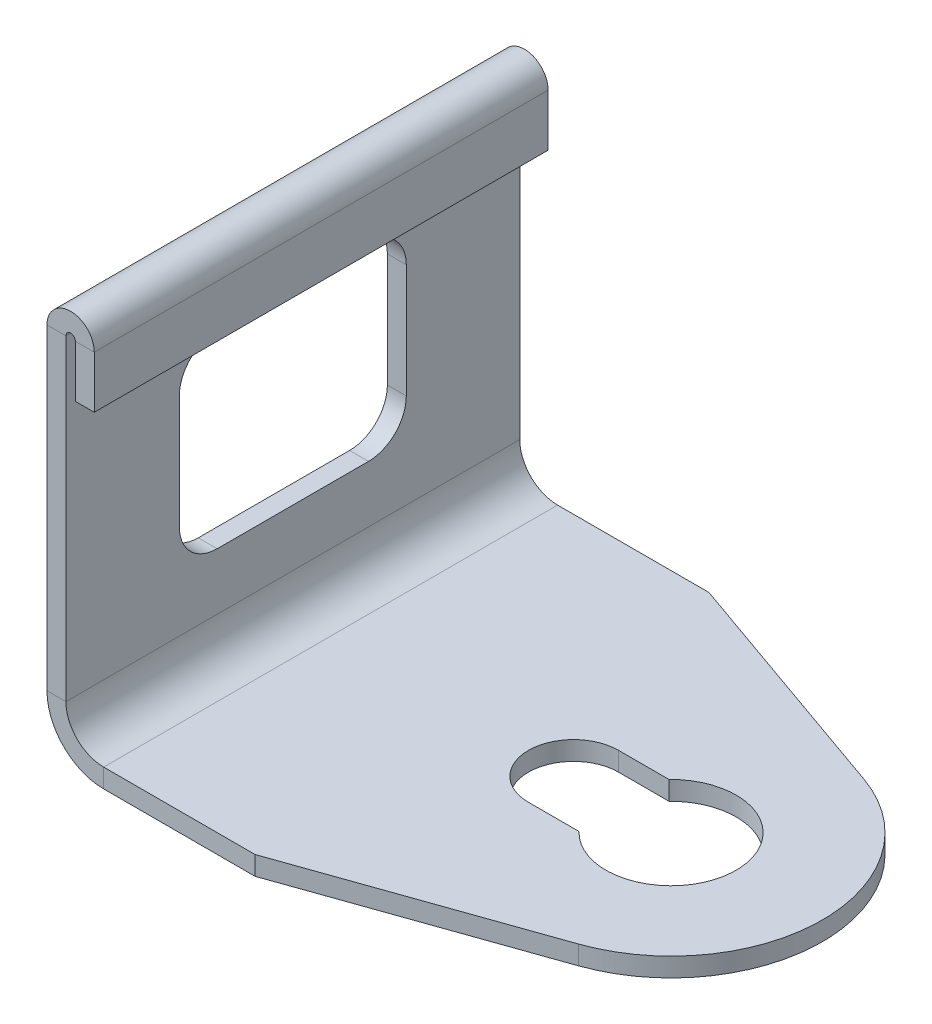
ISO-10303-21;
HEADER;
FILE_DESCRIPTION(('STEP AP214'),'2;1');
FILE_NAME('part.step','',(''),(''),'','','');
FILE_SCHEMA(('AUTOMOTIVE_DESIGN { 1 0 10303 214 1 1 1 1 }'));
ENDSEC;
DATA;
#1=APPLICATION_CONTEXT('core data for automotive mechanical design processes');
#2=APPLICATION_PROTOCOL_DEFINITION('international standard','automotive_design',2000,#1);
#3=PRODUCT_CONTEXT('',#1,'mechanical');
#4=PRODUCT('Part','Part','',(#3));
#5=PRODUCT_RELATED_PRODUCT_CATEGORY('part','',(#4));
#6=PRODUCT_DEFINITION_FORMATION('','',#4);
#7=PRODUCT_DEFINITION_CONTEXT('part definition',#1,'design');
#8=PRODUCT_DEFINITION('design','',#6,#7);
#9=PRODUCT_DEFINITION_SHAPE('','',#8);
#10=(LENGTH_UNIT() NAMED_UNIT(*) SI_UNIT(.MILLI.,.METRE.));
#11=(NAMED_UNIT(*) PLANE_ANGLE_UNIT() SI_UNIT($,.RADIAN.));
#12=(NAMED_UNIT(*) SI_UNIT($,.STERADIAN.) SOLID_ANGLE_UNIT());
#13=UNCERTAINTY_MEASURE_WITH_UNIT(LENGTH_MEASURE(1.E-05),#10,'distance_accuracy_value','');
#14=(GEOMETRIC_REPRESENTATION_CONTEXT(3) GLOBAL_UNCERTAINTY_ASSIGNED_CONTEXT((#13)) GLOBAL_UNIT_ASSIGNED_CONTEXT((#10,
#11,#12)) REPRESENTATION_CONTEXT('',''));
#15=CARTESIAN_POINT('',(0.,0.,0.));
#16=DIRECTION('',(0.,0.,1.));
#17=DIRECTION('',(1.,0.,0.));
#18=AXIS2_PLACEMENT_3D('',#15,#16,#17);
#19=CARTESIAN_POINT('',(15.5,1.,0.));
#20=DIRECTION('',(0.,1.,0.));
#21=DIRECTION('',(0.,0.,1.));
#22=AXIS2_PLACEMENT_3D('',#19,#20,#21);
#23=PLANE('',#22);
#24=DIRECTION('',(-1.,0.,0.));
#25=VECTOR('',#24,1.);
#26=CARTESIAN_POINT('',(10.34,1.,-2.38));
#27=LINE('',#26,#25);
#28=CARTESIAN_POINT('',(13.0124709060631,1.,-2.38));
#29=VERTEX_POINT('',#28);
#30=CARTESIAN_POINT('',(10.34,1.,-2.38));
#31=VERTEX_POINT('',#30);
#32=EDGE_CURVE('E405',#29,#31,#27,.T.);
#33=ORIENTED_EDGE('',*,*,#32,.F.);
#34=CARTESIAN_POINT('',(15.5,1.,0.));
#35=DIRECTION('',(0.,1.,0.));
#36=DIRECTION('',(0.,0.,1.));
#37=AXIS2_PLACEMENT_3D('',#34,#35,#36);
#38=CIRCLE('',#37,3.44270257111799);
#39=CARTESIAN_POINT('',(13.0124709060631,1.,2.38));
#40=VERTEX_POINT('',#39);
#41=EDGE_CURVE('E403',#40,#29,#38,.T.);
#42=ORIENTED_EDGE('',*,*,#41,.F.);
#43=DIRECTION('',(1.,0.,0.));
#44=VECTOR('',#43,1.);
#45=CARTESIAN_POINT('',(10.34,1.,2.38));
#46=LINE('',#45,#44);
#47=CARTESIAN_POINT('',(10.34,1.,2.38));
#48=VERTEX_POINT('',#47);
#49=EDGE_CURVE('E411',#48,#40,#46,.T.);
#50=ORIENTED_EDGE('',*,*,#49,.F.);
#51=CARTESIAN_POINT('',(10.34,1.,0.));
#52=DIRECTION('',(0.,1.,0.));
#53=DIRECTION('',(0.,0.,1.));
#54=AXIS2_PLACEMENT_3D('',#51,#52,#53);
#55=CIRCLE('',#54,2.38);
#56=EDGE_CURVE('E408',#31,#48,#55,.T.);
#57=ORIENTED_EDGE('',*,*,#56,.F.);
#58=EDGE_LOOP('',(#33,#42,#50,#57));
#59=FACE_BOUND('',#58,.T.);
#60=DIRECTION('',(-1.,0.,0.));
#61=VECTOR('',#60,1.);
#62=CARTESIAN_POINT('',(-5.50000000000001,1.,-12.));
#63=LINE('',#62,#61);
#64=CARTESIAN_POINT('',(5.49999999999999,1.,-12.));
#65=VERTEX_POINT('',#64);
#66=CARTESIAN_POINT('',(-2.50000000000001,1.,-12.));
#67=VERTEX_POINT('',#66);
#68=EDGE_CURVE('E442',#65,#67,#63,.T.);
#69=ORIENTED_EDGE('',*,*,#68,.T.);
#70=DIRECTION('',(0.,0.,1.));
#71=VECTOR('',#70,1.);
#72=CARTESIAN_POINT('',(-2.50000000000001,1.,12.));
#73=LINE('',#72,#71);
#74=CARTESIAN_POINT('',(-2.50000000000001,1.,12.));
#75=VERTEX_POINT('',#74);
#76=EDGE_CURVE('E392',#75,#67,#73,.F.);
#77=ORIENTED_EDGE('',*,*,#76,.F.);
#78=DIRECTION('',(1.,0.,0.));
#79=VECTOR('',#78,1.);
#80=CARTESIAN_POINT('',(-5.5,1.,12.));
#81=LINE('',#80,#79);
#82=CARTESIAN_POINT('',(5.5,1.,12.));
#83=VERTEX_POINT('',#82);
#84=EDGE_CURVE('E445',#75,#83,#81,.T.);
#85=ORIENTED_EDGE('',*,*,#84,.T.);
#86=DIRECTION('',(0.943295404303227,0.,-0.331954485163873));
#87=VECTOR('',#86,1.);
#88=CARTESIAN_POINT('',(18.155635881311,1.,7.54636323442581));
#89=LINE('',#88,#87);
#90=CARTESIAN_POINT('',(18.155635881311,1.,7.54636323442581));
#91=VERTEX_POINT('',#90);
#92=EDGE_CURVE('E434',#83,#91,#89,.T.);
#93=ORIENTED_EDGE('',*,*,#92,.T.);
#94=CARTESIAN_POINT('',(15.5,1.,0.));
#95=DIRECTION('',(0.,1.,0.));
#96=DIRECTION('',(0.,0.,1.));
#97=AXIS2_PLACEMENT_3D('',#94,#95,#96);
#98=CIRCLE('',#97,8.);
#99=CARTESIAN_POINT('',(18.155635881311,1.,-7.54636323442582));
#100=VERTEX_POINT('',#99);
#101=EDGE_CURVE('E437',#91,#100,#98,.T.);
#102=ORIENTED_EDGE('',*,*,#101,.T.);
#103=DIRECTION('',(-0.943295404303227,0.,-0.331954485163872));
#104=VECTOR('',#103,1.);
#105=CARTESIAN_POINT('',(18.155635881311,1.,-7.54636323442582));
#106=LINE('',#105,#104);
#107=EDGE_CURVE('E440',#100,#65,#106,.T.);
#108=ORIENTED_EDGE('',*,*,#107,.T.);
#109=EDGE_LOOP('',(#69,#77,#85,#93,#102,#108));
#110=FACE_BOUND('',#109,.T.);
#111=ADVANCED_FACE('F59',(#59,#110),#23,.T.);
#112=CARTESIAN_POINT('',(15.5,0.,0.));
#113=DIRECTION('',(0.,1.,0.));
#114=DIRECTION('',(0.,0.,1.));
#115=AXIS2_PLACEMENT_3D('',#112,#113,#114);
#116=PLANE('',#115);
#117=CARTESIAN_POINT('',(15.5,0.,0.));
#118=DIRECTION('',(0.,1.,0.));
#119=DIRECTION('',(0.,0.,1.));
#120=AXIS2_PLACEMENT_3D('',#117,#118,#119);
#121=CIRCLE('',#120,3.44270257111799);
#122=CARTESIAN_POINT('',(13.0124709060631,0.,2.38));
#123=VERTEX_POINT('',#122);
#124=CARTESIAN_POINT('',(13.0124709060631,0.,-2.38));
#125=VERTEX_POINT('',#124);
#126=EDGE_CURVE('E400',#123,#125,#121,.T.);
#127=ORIENTED_EDGE('',*,*,#126,.T.);
#128=DIRECTION('',(-1.,0.,0.));
#129=VECTOR('',#128,1.);
#130=CARTESIAN_POINT('',(10.34,0.,-2.38));
#131=LINE('',#130,#129);
#132=CARTESIAN_POINT('',(10.34,0.,-2.38));
#133=VERTEX_POINT('',#132);
#134=EDGE_CURVE('E416',#125,#133,#131,.T.);
#135=ORIENTED_EDGE('',*,*,#134,.T.);
#136=CARTESIAN_POINT('',(10.34,0.,0.));
#137=DIRECTION('',(0.,1.,0.));
#138=DIRECTION('',(0.,0.,1.));
#139=AXIS2_PLACEMENT_3D('',#136,#137,#138);
#140=CIRCLE('',#139,2.38);
#141=CARTESIAN_POINT('',(10.34,0.,2.38));
#142=VERTEX_POINT('',#141);
#143=EDGE_CURVE('E419',#133,#142,#140,.T.);
#144=ORIENTED_EDGE('',*,*,#143,.T.);
#145=DIRECTION('',(1.,0.,0.));
#146=VECTOR('',#145,1.);
#147=CARTESIAN_POINT('',(10.34,0.,2.38));
#148=LINE('',#147,#146);
#149=EDGE_CURVE('E406',#142,#123,#148,.T.);
#150=ORIENTED_EDGE('',*,*,#149,.T.);
#151=EDGE_LOOP('',(#127,#135,#144,#150));
#152=FACE_BOUND('',#151,.T.);
#153=DIRECTION('',(0.,0.,1.));
#154=VECTOR('',#153,1.);
#155=CARTESIAN_POINT('',(-2.50000000000001,0.,12.));
#156=LINE('',#155,#154);
#157=CARTESIAN_POINT('',(-2.50000000000001,0.,12.));
#158=VERTEX_POINT('',#157);
#159=CARTESIAN_POINT('',(-2.50000000000001,0.,-12.));
#160=VERTEX_POINT('',#159);
#161=EDGE_CURVE('E380',#158,#160,#156,.F.);
#162=ORIENTED_EDGE('',*,*,#161,.T.);
#163=DIRECTION('',(-1.,0.,0.));
#164=VECTOR('',#163,1.);
#165=CARTESIAN_POINT('',(-5.50000000000001,0.,-12.));
#166=LINE('',#165,#164);
#167=CARTESIAN_POINT('',(5.49999999999999,0.,-12.));
#168=VERTEX_POINT('',#167);
#169=EDGE_CURVE('E454',#168,#160,#166,.T.);
#170=ORIENTED_EDGE('',*,*,#169,.F.);
#171=DIRECTION('',(-0.943295404303227,0.,-0.331954485163872));
#172=VECTOR('',#171,1.);
#173=CARTESIAN_POINT('',(18.155635881311,0.,-7.54636323442582));
#174=LINE('',#173,#172);
#175=CARTESIAN_POINT('',(18.155635881311,0.,-7.54636323442582));
#176=VERTEX_POINT('',#175);
#177=EDGE_CURVE('E452',#176,#168,#174,.T.);
#178=ORIENTED_EDGE('',*,*,#177,.F.);
#179=CARTESIAN_POINT('',(15.5,0.,0.));
#180=DIRECTION('',(0.,1.,0.));
#181=DIRECTION('',(0.,0.,1.));
#182=AXIS2_PLACEMENT_3D('',#179,#180,#181);
#183=CIRCLE('',#182,8.);
#184=CARTESIAN_POINT('',(18.155635881311,0.,7.54636323442581));
#185=VERTEX_POINT('',#184);
#186=EDGE_CURVE('E450',#185,#176,#183,.T.);
#187=ORIENTED_EDGE('',*,*,#186,.F.);
#188=DIRECTION('',(0.943295404303227,0.,-0.331954485163873));
#189=VECTOR('',#188,1.);
#190=CARTESIAN_POINT('',(18.155635881311,0.,7.54636323442581));
#191=LINE('',#190,#189);
#192=CARTESIAN_POINT('',(5.5,0.,12.));
#193=VERTEX_POINT('',#192);
#194=EDGE_CURVE('E433',#193,#185,#191,.T.);
#195=ORIENTED_EDGE('',*,*,#194,.F.);
#196=DIRECTION('',(1.,0.,0.));
#197=VECTOR('',#196,1.);
#198=CARTESIAN_POINT('',(-5.5,0.,12.));
#199=LINE('',#198,#197);
#200=EDGE_CURVE('E438',#158,#193,#199,.T.);
#201=ORIENTED_EDGE('',*,*,#200,.F.);
#202=EDGE_LOOP('',(#162,#170,#178,#187,#195,#201));
#203=FACE_BOUND('',#202,.T.);
#204=ADVANCED_FACE('F472',(#152,#203),#116,.F.);
#205=CARTESIAN_POINT('',(-5.50000000000001,1.,-12.));
#206=DIRECTION('',(0.,0.,1.));
#207=DIRECTION('',(1.,0.,0.));
#208=AXIS2_PLACEMENT_3D('',#205,#206,#207);
#209=PLANE('',#208);
#210=DIRECTION('',(0.,-1.,0.));
#211=VECTOR('',#210,1.);
#212=CARTESIAN_POINT('',(-2.50000000000001,1.,-12.));
#213=LINE('',#212,#211);
#214=EDGE_CURVE('E397',#67,#160,#213,.T.);
#215=ORIENTED_EDGE('',*,*,#214,.F.);
#216=ORIENTED_EDGE('',*,*,#68,.F.);
#217=DIRECTION('',(0.,-1.,0.));
#218=VECTOR('',#217,1.);
#219=CARTESIAN_POINT('',(5.49999999999999,1.,-12.));
#220=LINE('',#219,#218);
#221=EDGE_CURVE('E460',#65,#168,#220,.T.);
#222=ORIENTED_EDGE('',*,*,#221,.T.);
#223=ORIENTED_EDGE('',*,*,#169,.T.);
#224=EDGE_LOOP('',(#215,#216,#222,#223));
#225=FACE_BOUND('',#224,.T.);
#226=ADVANCED_FACE('F476',(#225),#209,.F.);
#227=CARTESIAN_POINT('',(-5.5,1.,12.));
#228=DIRECTION('',(0.,0.,-1.));
#229=DIRECTION('',(-1.,0.,0.));
#230=AXIS2_PLACEMENT_3D('',#227,#228,#229);
#231=PLANE('',#230);
#232=DIRECTION('',(0.,-1.,0.));
#233=VECTOR('',#232,1.);
#234=CARTESIAN_POINT('',(-2.50000000000001,1.,12.));
#235=LINE('',#234,#233);
#236=EDGE_CURVE('E386',#75,#158,#235,.T.);
#237=ORIENTED_EDGE('',*,*,#236,.T.);
#238=ORIENTED_EDGE('',*,*,#200,.T.);
#239=DIRECTION('',(0.,-1.,0.));
#240=VECTOR('',#239,1.);
#241=CARTESIAN_POINT('',(5.5,1.,12.));
#242=LINE('',#241,#240);
#243=EDGE_CURVE('E447',#83,#193,#242,.T.);
#244=ORIENTED_EDGE('',*,*,#243,.F.);
#245=ORIENTED_EDGE('',*,*,#84,.F.);
#246=EDGE_LOOP('',(#237,#238,#244,#245));
#247=FACE_BOUND('',#246,.T.);
#248=ADVANCED_FACE('F548',(#247),#231,.F.);
#249=CARTESIAN_POINT('',(18.155635881311,1.,7.54636323442581));
#250=DIRECTION('',(-0.331954485163873,0.,-0.943295404303227));
#251=DIRECTION('',(-0.943295404303227,0.,0.331954485163873));
#252=AXIS2_PLACEMENT_3D('',#249,#250,#251);
#253=PLANE('',#252);
#254=ORIENTED_EDGE('',*,*,#194,.T.);
#255=DIRECTION('',(0.,-1.,0.));
#256=VECTOR('',#255,1.);
#257=CARTESIAN_POINT('',(18.155635881311,1.,7.54636323442581));
#258=LINE('',#257,#256);
#259=EDGE_CURVE('E13',#91,#185,#258,.T.);
#260=ORIENTED_EDGE('',*,*,#259,.F.);
#261=ORIENTED_EDGE('',*,*,#92,.F.);
#262=ORIENTED_EDGE('',*,*,#243,.T.);
#263=EDGE_LOOP('',(#254,#260,#261,#262));
#264=FACE_BOUND('',#263,.T.);
#265=ADVANCED_FACE('F61',(#264),#253,.F.);
#266=CARTESIAN_POINT('',(15.5,1.,0.));
#267=DIRECTION('',(0.,-1.,0.));
#268=DIRECTION('',(0.,0.,-1.));
#269=AXIS2_PLACEMENT_3D('',#266,#267,#268);
#270=CYLINDRICAL_SURFACE('',#269,8.);
#271=ORIENTED_EDGE('',*,*,#186,.T.);
#272=DIRECTION('',(0.,-1.,0.));
#273=VECTOR('',#272,1.);
#274=CARTESIAN_POINT('',(18.155635881311,1.,-7.54636323442582));
#275=LINE('',#274,#273);
#276=EDGE_CURVE('E67',#100,#176,#275,.T.);
#277=ORIENTED_EDGE('',*,*,#276,.F.);
#278=ORIENTED_EDGE('',*,*,#101,.F.);
#279=ORIENTED_EDGE('',*,*,#259,.T.);
#280=EDGE_LOOP('',(#271,#277,#278,#279));
#281=FACE_BOUND('',#280,.T.);
#282=ADVANCED_FACE('F555',(#281),#270,.T.);
#283=CARTESIAN_POINT('',(18.155635881311,1.,-7.54636323442582));
#284=DIRECTION('',(-0.331954485163872,0.,0.943295404303227));
#285=DIRECTION('',(0.943295404303227,0.,0.331954485163872));
#286=AXIS2_PLACEMENT_3D('',#283,#284,#285);
#287=PLANE('',#286);
#288=ORIENTED_EDGE('',*,*,#177,.T.);
#289=ORIENTED_EDGE('',*,*,#221,.F.);
#290=ORIENTED_EDGE('',*,*,#107,.F.);
#291=ORIENTED_EDGE('',*,*,#276,.T.);
#292=EDGE_LOOP('',(#288,#289,#290,#291));
#293=FACE_BOUND('',#292,.T.);
#294=ADVANCED_FACE('F467',(#293),#287,.F.);
#295=CARTESIAN_POINT('',(15.5,1.,0.));
#296=DIRECTION('',(0.,-1.,0.));
#297=DIRECTION('',(0.,0.,-1.));
#298=AXIS2_PLACEMENT_3D('',#295,#296,#297);
#299=CYLINDRICAL_SURFACE('',#298,3.44270257111799);
#300=ORIENTED_EDGE('',*,*,#126,.F.);
#301=DIRECTION('',(0.,-1.,0.));
#302=VECTOR('',#301,1.);
#303=CARTESIAN_POINT('',(13.0124709060631,1.,2.38));
#304=LINE('',#303,#302);
#305=EDGE_CURVE('E413',#40,#123,#304,.T.);
#306=ORIENTED_EDGE('',*,*,#305,.F.);
#307=ORIENTED_EDGE('',*,*,#41,.T.);
#308=DIRECTION('',(0.,-1.,0.));
#309=VECTOR('',#308,1.);
#310=CARTESIAN_POINT('',(13.0124709060631,1.,-2.38));
#311=LINE('',#310,#309);
#312=EDGE_CURVE('E430',#29,#125,#311,.T.);
#313=ORIENTED_EDGE('',*,*,#312,.T.);
#314=EDGE_LOOP('',(#300,#306,#307,#313));
#315=FACE_BOUND('',#314,.T.);
#316=ADVANCED_FACE('F545',(#315),#299,.F.);
#317=CARTESIAN_POINT('',(10.34,1.,-2.38));
#318=DIRECTION('',(0.,0.,1.));
#319=DIRECTION('',(1.,0.,0.));
#320=AXIS2_PLACEMENT_3D('',#317,#318,#319);
#321=PLANE('',#320);
#322=ORIENTED_EDGE('',*,*,#134,.F.);
#323=ORIENTED_EDGE('',*,*,#312,.F.);
#324=ORIENTED_EDGE('',*,*,#32,.T.);
#325=DIRECTION('',(0.,-1.,0.));
#326=VECTOR('',#325,1.);
#327=CARTESIAN_POINT('',(10.34,1.,-2.38));
#328=LINE('',#327,#326);
#329=EDGE_CURVE('E428',#31,#133,#328,.T.);
#330=ORIENTED_EDGE('',*,*,#329,.T.);
#331=EDGE_LOOP('',(#322,#323,#324,#330));
#332=FACE_BOUND('',#331,.T.);
#333=ADVANCED_FACE('F596',(#332),#321,.T.);
#334=CARTESIAN_POINT('',(10.34,1.,0.));
#335=DIRECTION('',(0.,-1.,0.));
#336=DIRECTION('',(0.,0.,-1.));
#337=AXIS2_PLACEMENT_3D('',#334,#335,#336);
#338=CYLINDRICAL_SURFACE('',#337,2.38);
#339=ORIENTED_EDGE('',*,*,#143,.F.);
#340=ORIENTED_EDGE('',*,*,#329,.F.);
#341=ORIENTED_EDGE('',*,*,#56,.T.);
#342=DIRECTION('',(0.,-1.,0.));
#343=VECTOR('',#342,1.);
#344=CARTESIAN_POINT('',(10.34,1.,2.38));
#345=LINE('',#344,#343);
#346=EDGE_CURVE('E426',#48,#142,#345,.T.);
#347=ORIENTED_EDGE('',*,*,#346,.T.);
#348=EDGE_LOOP('',(#339,#340,#341,#347));
#349=FACE_BOUND('',#348,.T.);
#350=ADVANCED_FACE('F593',(#349),#338,.F.);
#351=CARTESIAN_POINT('',(10.34,1.,2.38));
#352=DIRECTION('',(0.,0.,-1.));
#353=DIRECTION('',(-1.,0.,0.));
#354=AXIS2_PLACEMENT_3D('',#351,#352,#353);
#355=PLANE('',#354);
#356=ORIENTED_EDGE('',*,*,#149,.F.);
#357=ORIENTED_EDGE('',*,*,#346,.F.);
#358=ORIENTED_EDGE('',*,*,#49,.T.);
#359=ORIENTED_EDGE('',*,*,#305,.T.);
#360=EDGE_LOOP('',(#356,#357,#358,#359));
#361=FACE_BOUND('',#360,.T.);
#362=ADVANCED_FACE('F588',(#361),#355,.T.);
#363=CARTESIAN_POINT('',(-2.50000000000001,3.,-12.));
#364=DIRECTION('',(0.,0.,-1.));
#365=DIRECTION('',(-1.,0.,0.));
#366=AXIS2_PLACEMENT_3D('',#363,#364,#365);
#367=PLANE('',#366);
#368=DIRECTION('',(1.,0.,0.));
#369=VECTOR('',#368,1.);
#370=CARTESIAN_POINT('',(-5.50000000000001,2.99999999999999,-12.));
#371=LINE('',#370,#369);
#372=CARTESIAN_POINT('',(-4.50000000000001,2.99999999999999,-12.));
#373=VERTEX_POINT('',#372);
#374=CARTESIAN_POINT('',(-5.50000000000001,2.99999999999999,-12.));
#375=VERTEX_POINT('',#374);
#376=EDGE_CURVE('E357',#373,#375,#371,.F.);
#377=ORIENTED_EDGE('',*,*,#376,.F.);
#378=CARTESIAN_POINT('',(-2.50000000000001,3.,-12.));
#379=DIRECTION('',(0.,0.,1.));
#380=DIRECTION('',(1.,0.,0.));
#381=AXIS2_PLACEMENT_3D('',#378,#379,#380);
#382=CIRCLE('',#381,2.);
#383=EDGE_CURVE('E389',#67,#373,#382,.F.);
#384=ORIENTED_EDGE('',*,*,#383,.F.);
#385=ORIENTED_EDGE('',*,*,#214,.T.);
#386=CARTESIAN_POINT('',(-2.50000000000001,3.,-12.));
#387=DIRECTION('',(0.,0.,1.));
#388=DIRECTION('',(1.,0.,0.));
#389=AXIS2_PLACEMENT_3D('',#386,#387,#388);
#390=CIRCLE('',#389,3.);
#391=EDGE_CURVE('E382',#160,#375,#390,.F.);
#392=ORIENTED_EDGE('',*,*,#391,.T.);
#393=EDGE_LOOP('',(#377,#384,#385,#392));
#394=FACE_BOUND('',#393,.T.);
#395=ADVANCED_FACE('F482',(#394),#367,.T.);
#396=CARTESIAN_POINT('',(-2.50000000000001,3.,12.));
#397=DIRECTION('',(0.,0.,-1.));
#398=DIRECTION('',(-1.,0.,0.));
#399=AXIS2_PLACEMENT_3D('',#396,#397,#398);
#400=PLANE('',#399);
#401=CARTESIAN_POINT('',(-2.50000000000001,3.,12.));
#402=DIRECTION('',(0.,0.,1.));
#403=DIRECTION('',(1.,0.,0.));
#404=AXIS2_PLACEMENT_3D('',#401,#402,#403);
#405=CIRCLE('',#404,2.);
#406=CARTESIAN_POINT('',(-4.50000000000001,3.,12.));
#407=VERTEX_POINT('',#406);
#408=EDGE_CURVE('E362',#407,#75,#405,.T.);
#409=ORIENTED_EDGE('',*,*,#408,.F.);
#410=DIRECTION('',(1.,0.,0.));
#411=VECTOR('',#410,1.);
#412=CARTESIAN_POINT('',(-4.50000000000001,2.99999999999999,12.));
#413=LINE('',#412,#411);
#414=CARTESIAN_POINT('',(-5.50000000000001,2.99999999999999,12.));
#415=VERTEX_POINT('',#414);
#416=EDGE_CURVE('E373',#407,#415,#413,.F.);
#417=ORIENTED_EDGE('',*,*,#416,.T.);
#418=CARTESIAN_POINT('',(-2.50000000000001,3.,12.));
#419=DIRECTION('',(0.,0.,1.));
#420=DIRECTION('',(1.,0.,0.));
#421=AXIS2_PLACEMENT_3D('',#418,#419,#420);
#422=CIRCLE('',#421,3.);
#423=EDGE_CURVE('E383',#415,#158,#422,.T.);
#424=ORIENTED_EDGE('',*,*,#423,.T.);
#425=ORIENTED_EDGE('',*,*,#236,.F.);
#426=EDGE_LOOP('',(#409,#417,#424,#425));
#427=FACE_BOUND('',#426,.T.);
#428=ADVANCED_FACE('F568',(#427),#400,.F.);
#429=CARTESIAN_POINT('',(-2.50000000000001,3.,12.));
#430=DIRECTION('',(0.,0.,1.));
#431=DIRECTION('',(-1.,0.,0.));
#432=AXIS2_PLACEMENT_3D('',#429,#430,#431);
#433=CYLINDRICAL_SURFACE('',#432,3.);
#434=ORIENTED_EDGE('',*,*,#161,.F.);
#435=ORIENTED_EDGE('',*,*,#423,.F.);
#436=DIRECTION('',(0.,0.,1.));
#437=VECTOR('',#436,1.);
#438=CARTESIAN_POINT('',(-5.50000000000001,2.99999999999999,-12.));
#439=LINE('',#438,#437);
#440=EDGE_CURVE('E370',#415,#375,#439,.F.);
#441=ORIENTED_EDGE('',*,*,#440,.T.);
#442=ORIENTED_EDGE('',*,*,#391,.F.);
#443=EDGE_LOOP('',(#434,#435,#441,#442));
#444=FACE_BOUND('',#443,.T.);
#445=ADVANCED_FACE('F484',(#444),#433,.T.);
#446=CARTESIAN_POINT('',(-2.50000000000001,3.,12.));
#447=DIRECTION('',(0.,0.,1.));
#448=DIRECTION('',(-1.,0.,0.));
#449=AXIS2_PLACEMENT_3D('',#446,#447,#448);
#450=CYLINDRICAL_SURFACE('',#449,2.);
#451=ORIENTED_EDGE('',*,*,#76,.T.);
#452=ORIENTED_EDGE('',*,*,#383,.T.);
#453=DIRECTION('',(0.,0.,1.));
#454=VECTOR('',#453,1.);
#455=CARTESIAN_POINT('',(-4.50000000000001,2.99999999999999,-12.));
#456=LINE('',#455,#454);
#457=EDGE_CURVE('E376',#373,#407,#456,.T.);
#458=ORIENTED_EDGE('',*,*,#457,.T.);
#459=ORIENTED_EDGE('',*,*,#408,.T.);
#460=EDGE_LOOP('',(#451,#452,#458,#459));
#461=FACE_BOUND('',#460,.T.);
#462=ADVANCED_FACE('F570',(#461),#450,.F.);
#463=CARTESIAN_POINT('',(-5.50000000000001,0.999999999999997,-12.));
#464=DIRECTION('',(0.,0.,1.));
#465=DIRECTION('',(1.,0.,0.));
#466=AXIS2_PLACEMENT_3D('',#463,#464,#465);
#467=PLANE('',#466);
#468=DIRECTION('',(0.,-1.,0.));
#469=VECTOR('',#468,1.);
#470=CARTESIAN_POINT('',(-5.5,0.,-12.));
#471=LINE('',#470,#469);
#472=CARTESIAN_POINT('',(-5.50000000000007,19.75,-12.));
#473=VERTEX_POINT('',#472);
#474=EDGE_CURVE('E363',#473,#375,#471,.T.);
#475=ORIENTED_EDGE('',*,*,#474,.F.);
#476=DIRECTION('',(-1.,0.,0.));
#477=VECTOR('',#476,1.);
#478=CARTESIAN_POINT('',(-4.50000000000007,19.75,-12.));
#479=LINE('',#478,#477);
#480=CARTESIAN_POINT('',(-4.50000000000007,19.75,-12.));
#481=VERTEX_POINT('',#480);
#482=EDGE_CURVE('E321',#481,#473,#479,.T.);
#483=ORIENTED_EDGE('',*,*,#482,.F.);
#484=DIRECTION('',(0.,1.,0.));
#485=VECTOR('',#484,1.);
#486=CARTESIAN_POINT('',(-4.50000000000001,1.,-12.));
#487=LINE('',#486,#485);
#488=EDGE_CURVE('E368',#481,#373,#487,.F.);
#489=ORIENTED_EDGE('',*,*,#488,.T.);
#490=ORIENTED_EDGE('',*,*,#376,.T.);
#491=EDGE_LOOP('',(#475,#483,#489,#490));
#492=FACE_BOUND('',#491,.T.);
#493=ADVANCED_FACE('F573',(#492),#467,.F.);
#494=CARTESIAN_POINT('',(-5.50000000000007,21.,12.));
#495=DIRECTION('',(0.,0.,-1.));
#496=DIRECTION('',(-1.,0.,0.));
#497=AXIS2_PLACEMENT_3D('',#494,#495,#496);
#498=PLANE('',#497);
#499=DIRECTION('',(0.,-1.,0.));
#500=VECTOR('',#499,1.);
#501=CARTESIAN_POINT('',(-4.50000000000007,21.,12.));
#502=LINE('',#501,#500);
#503=CARTESIAN_POINT('',(-4.50000000000007,19.75,12.));
#504=VERTEX_POINT('',#503);
#505=EDGE_CURVE('E365',#407,#504,#502,.F.);
#506=ORIENTED_EDGE('',*,*,#505,.T.);
#507=DIRECTION('',(-1.,0.,0.));
#508=VECTOR('',#507,1.);
#509=CARTESIAN_POINT('',(-4.50000000000006,19.75,12.));
#510=LINE('',#509,#508);
#511=CARTESIAN_POINT('',(-5.50000000000007,19.75,12.));
#512=VERTEX_POINT('',#511);
#513=EDGE_CURVE('E310',#504,#512,#510,.T.);
#514=ORIENTED_EDGE('',*,*,#513,.T.);
#515=DIRECTION('',(0.,1.,0.));
#516=VECTOR('',#515,1.);
#517=CARTESIAN_POINT('',(-5.5,0.,12.));
#518=LINE('',#517,#516);
#519=EDGE_CURVE('E359',#415,#512,#518,.T.);
#520=ORIENTED_EDGE('',*,*,#519,.F.);
#521=ORIENTED_EDGE('',*,*,#416,.F.);
#522=EDGE_LOOP('',(#506,#514,#520,#521));
#523=FACE_BOUND('',#522,.T.);
#524=ADVANCED_FACE('F492',(#523),#498,.F.);
#525=CARTESIAN_POINT('',(-5.5,0.,0.));
#526=DIRECTION('',(1.,0.,0.));
#527=DIRECTION('',(0.,1.,0.));
#528=AXIS2_PLACEMENT_3D('',#525,#526,#527);
#529=PLANE('',#528);
#530=DIRECTION('',(0.,-1.,0.));
#531=VECTOR('',#530,1.);
#532=CARTESIAN_POINT('',(-5.5,0.,6.));
#533=LINE('',#532,#531);
#534=CARTESIAN_POINT('',(-5.50000000000005,13.9999999999999,6.));
#535=VERTEX_POINT('',#534);
#536=CARTESIAN_POINT('',(-5.50000000000004,7.99999999999992,6.));
#537=VERTEX_POINT('',#536);
#538=EDGE_CURVE('E296',#535,#537,#533,.T.);
#539=ORIENTED_EDGE('',*,*,#538,.T.);
#540=CARTESIAN_POINT('',(-5.50000000000003,7.99999999999992,4.));
#541=DIRECTION('',(1.,0.,0.));
#542=DIRECTION('',(0.,1.,0.));
#543=AXIS2_PLACEMENT_3D('',#540,#541,#542);
#544=CIRCLE('',#543,2.);
#545=CARTESIAN_POINT('',(-5.50000000000002,5.99999999999992,4.));
#546=VERTEX_POINT('',#545);
#547=EDGE_CURVE('E299',#537,#546,#544,.T.);
#548=ORIENTED_EDGE('',*,*,#547,.T.);
#549=DIRECTION('',(0.,0.,-1.));
#550=VECTOR('',#549,1.);
#551=CARTESIAN_POINT('',(-5.50000000000002,5.99999999999992,0.));
#552=LINE('',#551,#550);
#553=CARTESIAN_POINT('',(-5.50000000000002,5.99999999999992,-4.));
#554=VERTEX_POINT('',#553);
#555=EDGE_CURVE('E271',#546,#554,#552,.T.);
#556=ORIENTED_EDGE('',*,*,#555,.T.);
#557=CARTESIAN_POINT('',(-5.50000000000003,7.99999999999992,-4.));
#558=DIRECTION('',(1.,0.,0.));
#559=DIRECTION('',(0.,1.,0.));
#560=AXIS2_PLACEMENT_3D('',#557,#558,#559);
#561=CIRCLE('',#560,2.);
#562=CARTESIAN_POINT('',(-5.50000000000004,7.99999999999992,-6.));
#563=VERTEX_POINT('',#562);
#564=EDGE_CURVE('E238',#554,#563,#561,.T.);
#565=ORIENTED_EDGE('',*,*,#564,.T.);
#566=DIRECTION('',(0.,1.,0.));
#567=VECTOR('',#566,1.);
#568=CARTESIAN_POINT('',(-5.5,0.,-6.));
#569=LINE('',#568,#567);
#570=CARTESIAN_POINT('',(-5.50000000000004,13.9999999999999,-6.));
#571=VERTEX_POINT('',#570);
#572=EDGE_CURVE('E284',#563,#571,#569,.T.);
#573=ORIENTED_EDGE('',*,*,#572,.T.);
#574=CARTESIAN_POINT('',(-5.50000000000005,13.9999999999999,-4.));
#575=DIRECTION('',(1.,0.,0.));
#576=DIRECTION('',(0.,1.,0.));
#577=AXIS2_PLACEMENT_3D('',#574,#575,#576);
#578=CIRCLE('',#577,2.);
#579=CARTESIAN_POINT('',(-5.50000000000006,15.9999999999999,-4.));
#580=VERTEX_POINT('',#579);
#581=EDGE_CURVE('E287',#571,#580,#578,.T.);
#582=ORIENTED_EDGE('',*,*,#581,.T.);
#583=DIRECTION('',(0.,0.,1.));
#584=VECTOR('',#583,1.);
#585=CARTESIAN_POINT('',(-5.50000000000006,15.9999999999999,0.));
#586=LINE('',#585,#584);
#587=CARTESIAN_POINT('',(-5.50000000000006,15.9999999999999,4.));
#588=VERTEX_POINT('',#587);
#589=EDGE_CURVE('E290',#580,#588,#586,.T.);
#590=ORIENTED_EDGE('',*,*,#589,.T.);
#591=CARTESIAN_POINT('',(-5.50000000000005,13.9999999999999,4.));
#592=DIRECTION('',(1.,0.,0.));
#593=DIRECTION('',(0.,1.,0.));
#594=AXIS2_PLACEMENT_3D('',#591,#592,#593);
#595=CIRCLE('',#594,2.);
#596=EDGE_CURVE('E293',#588,#535,#595,.T.);
#597=ORIENTED_EDGE('',*,*,#596,.T.);
#598=EDGE_LOOP('',(#539,#548,#556,#565,#573,#582,#590,#597));
#599=FACE_BOUND('',#598,.T.);
#600=ORIENTED_EDGE('',*,*,#519,.T.);
#601=DIRECTION('',(0.,0.,1.));
#602=VECTOR('',#601,1.);
#603=CARTESIAN_POINT('',(-5.50000000000006,19.75,12.));
#604=LINE('',#603,#602);
#605=EDGE_CURVE('E303',#512,#473,#604,.F.);
#606=ORIENTED_EDGE('',*,*,#605,.T.);
#607=ORIENTED_EDGE('',*,*,#474,.T.);
#608=ORIENTED_EDGE('',*,*,#440,.F.);
#609=EDGE_LOOP('',(#600,#606,#607,#608));
#610=FACE_BOUND('',#609,.T.);
#611=ADVANCED_FACE('F488',(#599,#610),#529,.F.);
#612=CARTESIAN_POINT('',(-4.5,0.,0.));
#613=DIRECTION('',(1.,0.,0.));
#614=DIRECTION('',(0.,1.,0.));
#615=AXIS2_PLACEMENT_3D('',#612,#613,#614);
#616=PLANE('',#615);
#617=CARTESIAN_POINT('',(-4.50000000000003,7.99999999999992,4.));
#618=DIRECTION('',(1.,0.,0.));
#619=DIRECTION('',(0.,1.,0.));
#620=AXIS2_PLACEMENT_3D('',#617,#618,#619);
#621=CIRCLE('',#620,2.);
#622=CARTESIAN_POINT('',(-4.50000000000003,7.99999999999992,6.));
#623=VERTEX_POINT('',#622);
#624=CARTESIAN_POINT('',(-4.50000000000002,5.99999999999992,4.));
#625=VERTEX_POINT('',#624);
#626=EDGE_CURVE('E82',#623,#625,#621,.T.);
#627=ORIENTED_EDGE('',*,*,#626,.F.);
#628=DIRECTION('',(0.,-1.,0.));
#629=VECTOR('',#628,1.);
#630=CARTESIAN_POINT('',(-4.50000000000005,13.9999999999999,6.));
#631=LINE('',#630,#629);
#632=CARTESIAN_POINT('',(-4.50000000000005,13.9999999999999,6.));
#633=VERTEX_POINT('',#632);
#634=EDGE_CURVE('E266',#633,#623,#631,.T.);
#635=ORIENTED_EDGE('',*,*,#634,.F.);
#636=CARTESIAN_POINT('',(-4.50000000000005,13.9999999999999,4.));
#637=DIRECTION('',(1.,0.,0.));
#638=DIRECTION('',(0.,1.,0.));
#639=AXIS2_PLACEMENT_3D('',#636,#637,#638);
#640=CIRCLE('',#639,2.);
#641=CARTESIAN_POINT('',(-4.50000000000005,15.9999999999999,4.));
#642=VERTEX_POINT('',#641);
#643=EDGE_CURVE('E263',#642,#633,#640,.T.);
#644=ORIENTED_EDGE('',*,*,#643,.F.);
#645=DIRECTION('',(0.,0.,1.));
#646=VECTOR('',#645,1.);
#647=CARTESIAN_POINT('',(-4.50000000000005,15.9999999999999,4.));
#648=LINE('',#647,#646);
#649=CARTESIAN_POINT('',(-4.50000000000006,15.9999999999999,-4.));
#650=VERTEX_POINT('',#649);
#651=EDGE_CURVE('E260',#650,#642,#648,.T.);
#652=ORIENTED_EDGE('',*,*,#651,.F.);
#653=CARTESIAN_POINT('',(-4.50000000000005,13.9999999999999,-4.));
#654=DIRECTION('',(1.,0.,0.));
#655=DIRECTION('',(0.,1.,0.));
#656=AXIS2_PLACEMENT_3D('',#653,#654,#655);
#657=CIRCLE('',#656,2.);
#658=CARTESIAN_POINT('',(-4.50000000000005,13.9999999999999,-6.));
#659=VERTEX_POINT('',#658);
#660=EDGE_CURVE('E254',#659,#650,#657,.T.);
#661=ORIENTED_EDGE('',*,*,#660,.F.);
#662=DIRECTION('',(0.,1.,0.));
#663=VECTOR('',#662,1.);
#664=CARTESIAN_POINT('',(-4.50000000000005,13.9999999999999,-6.));
#665=LINE('',#664,#663);
#666=CARTESIAN_POINT('',(-4.50000000000003,7.99999999999992,-6.));
#667=VERTEX_POINT('',#666);
#668=EDGE_CURVE('E252',#667,#659,#665,.T.);
#669=ORIENTED_EDGE('',*,*,#668,.F.);
#670=CARTESIAN_POINT('',(-4.50000000000003,7.99999999999992,-4.));
#671=DIRECTION('',(1.,0.,0.));
#672=DIRECTION('',(0.,1.,0.));
#673=AXIS2_PLACEMENT_3D('',#670,#671,#672);
#674=CIRCLE('',#673,2.);
#675=CARTESIAN_POINT('',(-4.50000000000002,5.99999999999992,-4.));
#676=VERTEX_POINT('',#675);
#677=EDGE_CURVE('E235',#676,#667,#674,.T.);
#678=ORIENTED_EDGE('',*,*,#677,.F.);
#679=DIRECTION('',(0.,0.,-1.));
#680=VECTOR('',#679,1.);
#681=CARTESIAN_POINT('',(-4.50000000000002,5.99999999999992,4.));
#682=LINE('',#681,#680);
#683=EDGE_CURVE('E244',#625,#676,#682,.T.);
#684=ORIENTED_EDGE('',*,*,#683,.F.);
#685=EDGE_LOOP('',(#627,#635,#644,#652,#661,#669,#678,#684));
#686=FACE_BOUND('',#685,.T.);
#687=DIRECTION('',(0.,0.,1.));
#688=VECTOR('',#687,1.);
#689=CARTESIAN_POINT('',(-4.50000000000006,19.75,12.));
#690=LINE('',#689,#688);
#691=EDGE_CURVE('E316',#504,#481,#690,.F.);
#692=ORIENTED_EDGE('',*,*,#691,.F.);
#693=ORIENTED_EDGE('',*,*,#505,.F.);
#694=ORIENTED_EDGE('',*,*,#457,.F.);
#695=ORIENTED_EDGE('',*,*,#488,.F.);
#696=EDGE_LOOP('',(#692,#693,#694,#695));
#697=FACE_BOUND('',#696,.T.);
#698=ADVANCED_FACE('F248',(#686,#697),#616,.T.);
#699=CARTESIAN_POINT('',(-3.00000000000006,18.375,12.));
#700=DIRECTION('',(0.,0.,-1.));
#701=DIRECTION('',(0.,1.,0.));
#702=AXIS2_PLACEMENT_3D('',#699,#700,#701);
#703=PLANE('',#702);
#704=DIRECTION('',(1.,0.,0.));
#705=VECTOR('',#704,1.);
#706=CARTESIAN_POINT('',(-3.00000000000007,19.75,12.));
#707=LINE('',#706,#705);
#708=CARTESIAN_POINT('',(-4.00000000000007,19.75,12.));
#709=VERTEX_POINT('',#708);
#710=CARTESIAN_POINT('',(-3.00000000000007,19.75,12.));
#711=VERTEX_POINT('',#710);
#712=EDGE_CURVE('E351',#709,#711,#707,.T.);
#713=ORIENTED_EDGE('',*,*,#712,.F.);
#714=DIRECTION('',(0.,1.,0.));
#715=VECTOR('',#714,1.);
#716=CARTESIAN_POINT('',(-4.00000000000006,18.375,12.));
#717=LINE('',#716,#715);
#718=CARTESIAN_POINT('',(-4.00000000000006,17.,12.));
#719=VERTEX_POINT('',#718);
#720=EDGE_CURVE('E342',#719,#709,#717,.T.);
#721=ORIENTED_EDGE('',*,*,#720,.F.);
#722=DIRECTION('',(1.,0.,0.));
#723=VECTOR('',#722,1.);
#724=CARTESIAN_POINT('',(-3.00000000000006,17.,12.));
#725=LINE('',#724,#723);
#726=CARTESIAN_POINT('',(-3.00000000000006,17.,12.));
#727=VERTEX_POINT('',#726);
#728=EDGE_CURVE('E349',#719,#727,#725,.T.);
#729=ORIENTED_EDGE('',*,*,#728,.T.);
#730=DIRECTION('',(0.,1.,0.));
#731=VECTOR('',#730,1.);
#732=CARTESIAN_POINT('',(-3.00000000000006,18.375,12.));
#733=LINE('',#732,#731);
#734=EDGE_CURVE('E330',#727,#711,#733,.T.);
#735=ORIENTED_EDGE('',*,*,#734,.T.);
#736=EDGE_LOOP('',(#713,#721,#729,#735));
#737=FACE_BOUND('',#736,.T.);
#738=ADVANCED_FACE('F522',(#737),#703,.F.);
#739=CARTESIAN_POINT('',(-3.00000000000006,17.,0.));
#740=DIRECTION('',(0.,1.,0.));
#741=DIRECTION('',(0.,0.,1.));
#742=AXIS2_PLACEMENT_3D('',#739,#740,#741);
#743=PLANE('',#742);
#744=ORIENTED_EDGE('',*,*,#728,.F.);
#745=DIRECTION('',(0.,0.,1.));
#746=VECTOR('',#745,1.);
#747=CARTESIAN_POINT('',(-4.00000000000006,17.,0.));
#748=LINE('',#747,#746);
#749=CARTESIAN_POINT('',(-4.00000000000006,17.,-12.));
#750=VERTEX_POINT('',#749);
#751=EDGE_CURVE('E339',#750,#719,#748,.T.);
#752=ORIENTED_EDGE('',*,*,#751,.F.);
#753=DIRECTION('',(1.,0.,0.));
#754=VECTOR('',#753,1.);
#755=CARTESIAN_POINT('',(-3.00000000000006,17.,-12.));
#756=LINE('',#755,#754);
#757=CARTESIAN_POINT('',(-3.00000000000006,17.,-12.));
#758=VERTEX_POINT('',#757);
#759=EDGE_CURVE('E329',#750,#758,#756,.T.);
#760=ORIENTED_EDGE('',*,*,#759,.T.);
#761=DIRECTION('',(0.,0.,1.));
#762=VECTOR('',#761,1.);
#763=CARTESIAN_POINT('',(-3.00000000000006,17.,0.));
#764=LINE('',#763,#762);
#765=EDGE_CURVE('E326',#758,#727,#764,.T.);
#766=ORIENTED_EDGE('',*,*,#765,.T.);
#767=EDGE_LOOP('',(#744,#752,#760,#766));
#768=FACE_BOUND('',#767,.T.);
#769=ADVANCED_FACE('F524',(#768),#743,.F.);
#770=CARTESIAN_POINT('',(-3.00000000000007,18.375,-12.));
#771=DIRECTION('',(0.,0.,1.));
#772=DIRECTION('',(0.,-1.,0.));
#773=AXIS2_PLACEMENT_3D('',#770,#771,#772);
#774=PLANE('',#773);
#775=DIRECTION('',(0.,1.,0.));
#776=VECTOR('',#775,1.);
#777=CARTESIAN_POINT('',(-4.00000000000007,18.375,-12.));
#778=LINE('',#777,#776);
#779=CARTESIAN_POINT('',(-4.00000000000007,19.75,-12.));
#780=VERTEX_POINT('',#779);
#781=EDGE_CURVE('E324',#780,#750,#778,.F.);
#782=ORIENTED_EDGE('',*,*,#781,.F.);
#783=DIRECTION('',(1.,0.,0.));
#784=VECTOR('',#783,1.);
#785=CARTESIAN_POINT('',(-3.00000000000007,19.75,-12.));
#786=LINE('',#785,#784);
#787=CARTESIAN_POINT('',(-3.00000000000007,19.75,-12.));
#788=VERTEX_POINT('',#787);
#789=EDGE_CURVE('E354',#780,#788,#786,.T.);
#790=ORIENTED_EDGE('',*,*,#789,.T.);
#791=DIRECTION('',(0.,-1.,0.));
#792=VECTOR('',#791,1.);
#793=CARTESIAN_POINT('',(-3.00000000000007,18.375,-12.));
#794=LINE('',#793,#792);
#795=EDGE_CURVE('E336',#788,#758,#794,.T.);
#796=ORIENTED_EDGE('',*,*,#795,.T.);
#797=ORIENTED_EDGE('',*,*,#759,.F.);
#798=EDGE_LOOP('',(#782,#790,#796,#797));
#799=FACE_BOUND('',#798,.T.);
#800=ADVANCED_FACE('F510',(#799),#774,.F.);
#801=CARTESIAN_POINT('',(-3.00000000000006,18.375,0.));
#802=DIRECTION('',(1.,0.,0.));
#803=DIRECTION('',(0.,1.,0.));
#804=AXIS2_PLACEMENT_3D('',#801,#802,#803);
#805=PLANE('',#804);
#806=ORIENTED_EDGE('',*,*,#765,.F.);
#807=ORIENTED_EDGE('',*,*,#795,.F.);
#808=DIRECTION('',(0.,0.,-1.));
#809=VECTOR('',#808,1.);
#810=CARTESIAN_POINT('',(-3.00000000000007,19.75,0.));
#811=LINE('',#810,#809);
#812=EDGE_CURVE('E333',#711,#788,#811,.T.);
#813=ORIENTED_EDGE('',*,*,#812,.F.);
#814=ORIENTED_EDGE('',*,*,#734,.F.);
#815=EDGE_LOOP('',(#806,#807,#813,#814));
#816=FACE_BOUND('',#815,.T.);
#817=ADVANCED_FACE('F520',(#816),#805,.T.);
#818=CARTESIAN_POINT('',(-4.00000000000006,18.375,0.));
#819=DIRECTION('',(1.,0.,0.));
#820=DIRECTION('',(0.,1.,0.));
#821=AXIS2_PLACEMENT_3D('',#818,#819,#820);
#822=PLANE('',#821);
#823=ORIENTED_EDGE('',*,*,#751,.T.);
#824=ORIENTED_EDGE('',*,*,#720,.T.);
#825=DIRECTION('',(0.,0.,1.));
#826=VECTOR('',#825,1.);
#827=CARTESIAN_POINT('',(-4.00000000000007,19.75,0.));
#828=LINE('',#827,#826);
#829=EDGE_CURVE('E345',#709,#780,#828,.F.);
#830=ORIENTED_EDGE('',*,*,#829,.T.);
#831=ORIENTED_EDGE('',*,*,#781,.T.);
#832=EDGE_LOOP('',(#823,#824,#830,#831));
#833=FACE_BOUND('',#832,.T.);
#834=ADVANCED_FACE('F505',(#833),#822,.F.);
#835=CARTESIAN_POINT('',(-4.25000000000007,19.75,-12.));
#836=DIRECTION('',(0.,0.,-1.));
#837=DIRECTION('',(-1.,0.,0.));
#838=AXIS2_PLACEMENT_3D('',#835,#836,#837);
#839=PLANE('',#838);
#840=ORIENTED_EDGE('',*,*,#789,.F.);
#841=CARTESIAN_POINT('',(-4.25000000000007,19.75,-12.));
#842=DIRECTION('',(0.,0.,1.));
#843=DIRECTION('',(1.,0.,0.));
#844=AXIS2_PLACEMENT_3D('',#841,#842,#843);
#845=CIRCLE('',#844,0.249999999999999);
#846=EDGE_CURVE('E313',#481,#780,#845,.F.);
#847=ORIENTED_EDGE('',*,*,#846,.F.);
#848=ORIENTED_EDGE('',*,*,#482,.T.);
#849=CARTESIAN_POINT('',(-4.25000000000007,19.75,-12.));
#850=DIRECTION('',(0.,0.,1.));
#851=DIRECTION('',(1.,0.,0.));
#852=AXIS2_PLACEMENT_3D('',#849,#850,#851);
#853=CIRCLE('',#852,1.25);
#854=EDGE_CURVE('E306',#473,#788,#853,.F.);
#855=ORIENTED_EDGE('',*,*,#854,.T.);
#856=EDGE_LOOP('',(#840,#847,#848,#855));
#857=FACE_BOUND('',#856,.T.);
#858=ADVANCED_FACE('F512',(#857),#839,.T.);
#859=CARTESIAN_POINT('',(-4.25000000000007,19.75,12.));
#860=DIRECTION('',(0.,0.,-1.));
#861=DIRECTION('',(-1.,0.,0.));
#862=AXIS2_PLACEMENT_3D('',#859,#860,#861);
#863=PLANE('',#862);
#864=CARTESIAN_POINT('',(-4.25000000000007,19.75,12.));
#865=DIRECTION('',(0.,0.,1.));
#866=DIRECTION('',(1.,0.,0.));
#867=AXIS2_PLACEMENT_3D('',#864,#865,#866);
#868=CIRCLE('',#867,0.249999999999999);
#869=EDGE_CURVE('E302',#709,#504,#868,.T.);
#870=ORIENTED_EDGE('',*,*,#869,.F.);
#871=ORIENTED_EDGE('',*,*,#712,.T.);
#872=CARTESIAN_POINT('',(-4.25000000000007,19.75,12.));
#873=DIRECTION('',(0.,0.,1.));
#874=DIRECTION('',(1.,0.,0.));
#875=AXIS2_PLACEMENT_3D('',#872,#873,#874);
#876=CIRCLE('',#875,1.25);
#877=EDGE_CURVE('E307',#711,#512,#876,.T.);
#878=ORIENTED_EDGE('',*,*,#877,.T.);
#879=ORIENTED_EDGE('',*,*,#513,.F.);
#880=EDGE_LOOP('',(#870,#871,#878,#879));
#881=FACE_BOUND('',#880,.T.);
#882=ADVANCED_FACE('F497',(#881),#863,.F.);
#883=CARTESIAN_POINT('',(-4.25000000000007,19.75,12.));
#884=DIRECTION('',(0.,0.,1.));
#885=DIRECTION('',(1.,0.,0.));
#886=AXIS2_PLACEMENT_3D('',#883,#884,#885);
#887=CYLINDRICAL_SURFACE('',#886,1.25);
#888=ORIENTED_EDGE('',*,*,#605,.F.);
#889=ORIENTED_EDGE('',*,*,#877,.F.);
#890=ORIENTED_EDGE('',*,*,#812,.T.);
#891=ORIENTED_EDGE('',*,*,#854,.F.);
#892=EDGE_LOOP('',(#888,#889,#890,#891));
#893=FACE_BOUND('',#892,.T.);
#894=ADVANCED_FACE('F516',(#893),#887,.T.);
#895=CARTESIAN_POINT('',(-4.25000000000007,19.75,12.));
#896=DIRECTION('',(0.,0.,1.));
#897=DIRECTION('',(1.,0.,0.));
#898=AXIS2_PLACEMENT_3D('',#895,#896,#897);
#899=CYLINDRICAL_SURFACE('',#898,0.249999999999999);
#900=ORIENTED_EDGE('',*,*,#691,.T.);
#901=ORIENTED_EDGE('',*,*,#846,.T.);
#902=ORIENTED_EDGE('',*,*,#829,.F.);
#903=ORIENTED_EDGE('',*,*,#869,.T.);
#904=EDGE_LOOP('',(#900,#901,#902,#903));
#905=FACE_BOUND('',#904,.T.);
#906=ADVANCED_FACE('F501',(#905),#899,.F.);
#907=CARTESIAN_POINT('',(-14.5,7.99999999999989,4.));
#908=DIRECTION('',(1.,0.,0.));
#909=DIRECTION('',(0.,1.,0.));
#910=AXIS2_PLACEMENT_3D('',#907,#908,#909);
#911=CYLINDRICAL_SURFACE('',#910,2.);
#912=DIRECTION('',(1.,0.,0.));
#913=VECTOR('',#912,1.);
#914=CARTESIAN_POINT('',(-14.5,7.99999999999989,6.));
#915=LINE('',#914,#913);
#916=EDGE_CURVE('E269',#537,#623,#915,.T.);
#917=ORIENTED_EDGE('',*,*,#916,.T.);
#918=ORIENTED_EDGE('',*,*,#626,.T.);
#919=DIRECTION('',(1.,0.,0.));
#920=VECTOR('',#919,1.);
#921=CARTESIAN_POINT('',(-14.5,5.99999999999989,4.));
#922=LINE('',#921,#920);
#923=EDGE_CURVE('E241',#546,#625,#922,.T.);
#924=ORIENTED_EDGE('',*,*,#923,.F.);
#925=ORIENTED_EDGE('',*,*,#547,.F.);
#926=EDGE_LOOP('',(#917,#918,#924,#925));
#927=FACE_BOUND('',#926,.T.);
#928=ADVANCED_FACE('F825',(#927),#911,.F.);
#929=CARTESIAN_POINT('',(-14.5,13.9999999999999,6.));
#930=DIRECTION('',(0.,0.,1.));
#931=DIRECTION('',(1.,0.,0.));
#932=AXIS2_PLACEMENT_3D('',#929,#930,#931);
#933=PLANE('',#932);
#934=DIRECTION('',(1.,0.,0.));
#935=VECTOR('',#934,1.);
#936=CARTESIAN_POINT('',(-14.5,13.9999999999999,6.));
#937=LINE('',#936,#935);
#938=EDGE_CURVE('E272',#535,#633,#937,.T.);
#939=ORIENTED_EDGE('',*,*,#938,.T.);
#940=ORIENTED_EDGE('',*,*,#634,.T.);
#941=ORIENTED_EDGE('',*,*,#916,.F.);
#942=ORIENTED_EDGE('',*,*,#538,.F.);
#943=EDGE_LOOP('',(#939,#940,#941,#942));
#944=FACE_BOUND('',#943,.T.);
#945=ADVANCED_FACE('F834',(#944),#933,.F.);
#946=CARTESIAN_POINT('',(-14.5,13.9999999999999,4.));
#947=DIRECTION('',(1.,0.,0.));
#948=DIRECTION('',(0.,1.,0.));
#949=AXIS2_PLACEMENT_3D('',#946,#947,#948);
#950=CYLINDRICAL_SURFACE('',#949,2.);
#951=DIRECTION('',(1.,0.,0.));
#952=VECTOR('',#951,1.);
#953=CARTESIAN_POINT('',(-14.5000000000001,15.9999999999999,4.));
#954=LINE('',#953,#952);
#955=EDGE_CURVE('E274',#588,#642,#954,.T.);
#956=ORIENTED_EDGE('',*,*,#955,.T.);
#957=ORIENTED_EDGE('',*,*,#643,.T.);
#958=ORIENTED_EDGE('',*,*,#938,.F.);
#959=ORIENTED_EDGE('',*,*,#596,.F.);
#960=EDGE_LOOP('',(#956,#957,#958,#959));
#961=FACE_BOUND('',#960,.T.);
#962=ADVANCED_FACE('F844',(#961),#950,.F.);
#963=CARTESIAN_POINT('',(-14.5000000000001,15.9999999999999,4.));
#964=DIRECTION('',(0.,1.,0.));
#965=DIRECTION('',(-1.,0.,0.));
#966=AXIS2_PLACEMENT_3D('',#963,#964,#965);
#967=PLANE('',#966);
#968=DIRECTION('',(1.,0.,0.));
#969=VECTOR('',#968,1.);
#970=CARTESIAN_POINT('',(-14.5000000000001,15.9999999999999,-4.));
#971=LINE('',#970,#969);
#972=EDGE_CURVE('E276',#580,#650,#971,.T.);
#973=ORIENTED_EDGE('',*,*,#972,.T.);
#974=ORIENTED_EDGE('',*,*,#651,.T.);
#975=ORIENTED_EDGE('',*,*,#955,.F.);
#976=ORIENTED_EDGE('',*,*,#589,.F.);
#977=EDGE_LOOP('',(#973,#974,#975,#976));
#978=FACE_BOUND('',#977,.T.);
#979=ADVANCED_FACE('F855',(#978),#967,.F.);
#980=CARTESIAN_POINT('',(-14.5000000000001,13.9999999999999,-4.));
#981=DIRECTION('',(1.,0.,0.));
#982=DIRECTION('',(0.,1.,0.));
#983=AXIS2_PLACEMENT_3D('',#980,#981,#982);
#984=CYLINDRICAL_SURFACE('',#983,2.);
#985=DIRECTION('',(1.,0.,0.));
#986=VECTOR('',#985,1.);
#987=CARTESIAN_POINT('',(-14.5000000000001,13.9999999999999,-5.99999999999999));
#988=LINE('',#987,#986);
#989=EDGE_CURVE('E278',#571,#659,#988,.T.);
#990=ORIENTED_EDGE('',*,*,#989,.T.);
#991=ORIENTED_EDGE('',*,*,#660,.T.);
#992=ORIENTED_EDGE('',*,*,#972,.F.);
#993=ORIENTED_EDGE('',*,*,#581,.F.);
#994=EDGE_LOOP('',(#990,#991,#992,#993));
#995=FACE_BOUND('',#994,.T.);
#996=ADVANCED_FACE('F866',(#995),#984,.F.);
#997=CARTESIAN_POINT('',(-14.5000000000001,13.9999999999999,-6.));
#998=DIRECTION('',(0.,0.,-1.));
#999=DIRECTION('',(0.,1.,0.));
#1000=AXIS2_PLACEMENT_3D('',#997,#998,#999);
#1001=PLANE('',#1000);
#1002=DIRECTION('',(1.,0.,0.));
#1003=VECTOR('',#1002,1.);
#1004=CARTESIAN_POINT('',(-14.5,7.99999999999989,-6.));
#1005=LINE('',#1004,#1003);
#1006=EDGE_CURVE('E240',#563,#667,#1005,.T.);
#1007=ORIENTED_EDGE('',*,*,#1006,.T.);
#1008=ORIENTED_EDGE('',*,*,#668,.T.);
#1009=ORIENTED_EDGE('',*,*,#989,.F.);
#1010=ORIENTED_EDGE('',*,*,#572,.F.);
#1011=EDGE_LOOP('',(#1007,#1008,#1009,#1010));
#1012=FACE_BOUND('',#1011,.T.);
#1013=ADVANCED_FACE('F877',(#1012),#1001,.F.);
#1014=CARTESIAN_POINT('',(-14.5,7.99999999999989,-4.));
#1015=DIRECTION('',(1.,0.,0.));
#1016=DIRECTION('',(0.,1.,0.));
#1017=AXIS2_PLACEMENT_3D('',#1014,#1015,#1016);
#1018=CYLINDRICAL_SURFACE('',#1017,2.);
#1019=DIRECTION('',(1.,0.,0.));
#1020=VECTOR('',#1019,1.);
#1021=CARTESIAN_POINT('',(-14.5,5.99999999999989,-4.));
#1022=LINE('',#1021,#1020);
#1023=EDGE_CURVE('E74',#554,#676,#1022,.T.);
#1024=ORIENTED_EDGE('',*,*,#1023,.T.);
#1025=ORIENTED_EDGE('',*,*,#677,.T.);
#1026=ORIENTED_EDGE('',*,*,#1006,.F.);
#1027=ORIENTED_EDGE('',*,*,#564,.F.);
#1028=EDGE_LOOP('',(#1024,#1025,#1026,#1027));
#1029=FACE_BOUND('',#1028,.T.);
#1030=ADVANCED_FACE('F232',(#1029),#1018,.F.);
#1031=CARTESIAN_POINT('',(-14.5,5.99999999999989,4.));
#1032=DIRECTION('',(0.,-1.,0.));
#1033=DIRECTION('',(1.,0.,0.));
#1034=AXIS2_PLACEMENT_3D('',#1031,#1032,#1033);
#1035=PLANE('',#1034);
#1036=ORIENTED_EDGE('',*,*,#923,.T.);
#1037=ORIENTED_EDGE('',*,*,#683,.T.);
#1038=ORIENTED_EDGE('',*,*,#1023,.F.);
#1039=ORIENTED_EDGE('',*,*,#555,.F.);
#1040=EDGE_LOOP('',(#1036,#1037,#1038,#1039));
#1041=FACE_BOUND('',#1040,.T.);
#1042=ADVANCED_FACE('F245',(#1041),#1035,.F.);
#1043=CLOSED_SHELL('',(#111,#204,#226,#248,#265,#282,#294,#316,#333,#350,#362,#395,#428,#445,
#462,#493,#524,#611,#698,#738,#769,#800,#817,#834,#858,#882,#894,#906,#928,#945,#962,#979,#996,
#1013,#1030,#1042));
#1044=MANIFOLD_SOLID_BREP('B2',#1043);
#1045=ADVANCED_BREP_SHAPE_REPRESENTATION('',(#18,#1044),#14);
#1046=SHAPE_DEFINITION_REPRESENTATION(#9,#1045);
ENDSEC;
END-ISO-10303-21;
